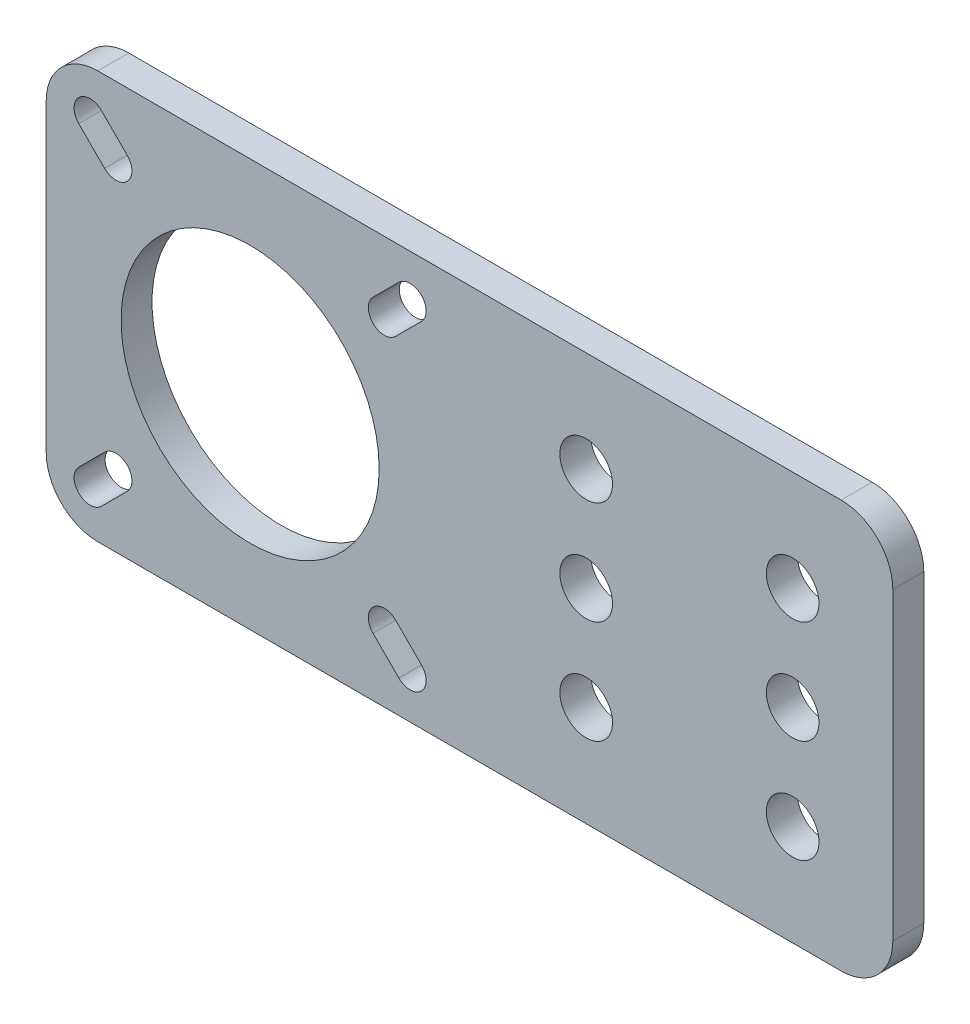
ISO-10303-21;
HEADER;
FILE_DESCRIPTION(('STEP AP214'),'2;1');
FILE_NAME('part.step','',(''),(''),'','','');
FILE_SCHEMA(('AUTOMOTIVE_DESIGN { 1 0 10303 214 1 1 1 1 }'));
ENDSEC;
DATA;
#1=APPLICATION_CONTEXT('core data for automotive mechanical design processes');
#2=APPLICATION_PROTOCOL_DEFINITION('international standard','automotive_design',2000,#1);
#3=PRODUCT_CONTEXT('',#1,'mechanical');
#4=PRODUCT('Part','Part','',(#3));
#5=PRODUCT_RELATED_PRODUCT_CATEGORY('part','',(#4));
#6=PRODUCT_DEFINITION_FORMATION('','',#4);
#7=PRODUCT_DEFINITION_CONTEXT('part definition',#1,'design');
#8=PRODUCT_DEFINITION('design','',#6,#7);
#9=PRODUCT_DEFINITION_SHAPE('','',#8);
#10=(LENGTH_UNIT() NAMED_UNIT(*) SI_UNIT(.MILLI.,.METRE.));
#11=(NAMED_UNIT(*) PLANE_ANGLE_UNIT() SI_UNIT($,.RADIAN.));
#12=(NAMED_UNIT(*) SI_UNIT($,.STERADIAN.) SOLID_ANGLE_UNIT());
#13=UNCERTAINTY_MEASURE_WITH_UNIT(LENGTH_MEASURE(1.E-05),#10,'distance_accuracy_value','');
#14=(GEOMETRIC_REPRESENTATION_CONTEXT(3) GLOBAL_UNCERTAINTY_ASSIGNED_CONTEXT((#13)) GLOBAL_UNIT_ASSIGNED_CONTEXT((#10,
#11,#12)) REPRESENTATION_CONTEXT('',''));
#15=CARTESIAN_POINT('',(0.,0.,0.));
#16=DIRECTION('',(0.,0.,1.));
#17=DIRECTION('',(1.,0.,0.));
#18=AXIS2_PLACEMENT_3D('',#15,#16,#17);
#19=CARTESIAN_POINT('',(0.,0.,3.));
#20=DIRECTION('',(0.,0.,-1.));
#21=DIRECTION('',(-1.,0.,0.));
#22=AXIS2_PLACEMENT_3D('',#19,#20,#21);
#23=PLANE('',#22);
#24=CARTESIAN_POINT('',(72.2999999999999,19.75,3.));
#25=DIRECTION('',(0.,0.,1.));
#26=DIRECTION('',(-1.,0.,0.));
#27=AXIS2_PLACEMENT_3D('',#24,#25,#26);
#28=CIRCLE('',#27,2.55000000000001);
#29=CARTESIAN_POINT('',(69.7499999999999,19.75,3.));
#30=VERTEX_POINT('',#29);
#31=EDGE_CURVE('E742',#30,#30,#28,.T.);
#32=ORIENTED_EDGE('',*,*,#31,.F.);
#33=EDGE_LOOP('',(#32));
#34=FACE_BOUND('',#33,.T.);
#35=CARTESIAN_POINT('',(52.2999999999998,9.75,3.));
#36=DIRECTION('',(0.,0.,1.));
#37=DIRECTION('',(1.,0.,0.));
#38=AXIS2_PLACEMENT_3D('',#35,#36,#37);
#39=CIRCLE('',#38,2.55);
#40=CARTESIAN_POINT('',(54.8499999999998,9.75,3.));
#41=VERTEX_POINT('',#40);
#42=EDGE_CURVE('E754',#41,#41,#39,.T.);
#43=ORIENTED_EDGE('',*,*,#42,.F.);
#44=EDGE_LOOP('',(#43));
#45=FACE_BOUND('',#44,.T.);
#46=CARTESIAN_POINT('',(52.2999999999998,19.75,3.));
#47=DIRECTION('',(0.,0.,1.));
#48=DIRECTION('',(1.,0.,0.));
#49=AXIS2_PLACEMENT_3D('',#46,#47,#48);
#50=CIRCLE('',#49,2.55);
#51=CARTESIAN_POINT('',(54.8499999999998,19.75,3.));
#52=VERTEX_POINT('',#51);
#53=EDGE_CURVE('E228',#52,#52,#50,.T.);
#54=ORIENTED_EDGE('',*,*,#53,.F.);
#55=EDGE_LOOP('',(#54));
#56=FACE_BOUND('',#55,.T.);
#57=CARTESIAN_POINT('',(35.2499999999996,4.25,3.));
#58=DIRECTION('',(0.,0.,1.));
#59=DIRECTION('',(1.,0.,0.));
#60=AXIS2_PLACEMENT_3D('',#57,#58,#59);
#61=CIRCLE('',#60,1.55);
#62=CARTESIAN_POINT('',(34.1539844891605,3.15398448916086,3.));
#63=VERTEX_POINT('',#62);
#64=CARTESIAN_POINT('',(36.3460155108388,5.34601551083915,3.));
#65=VERTEX_POINT('',#64);
#66=EDGE_CURVE('E239',#63,#65,#61,.T.);
#67=ORIENTED_EDGE('',*,*,#66,.F.);
#68=DIRECTION('',(0.707106781186543,-0.707106781186552,0.));
#69=VECTOR('',#68,1.);
#70=CARTESIAN_POINT('',(34.1539844891605,3.15398448916086,3.));
#71=LINE('',#70,#69);
#72=CARTESIAN_POINT('',(31.6539844891605,5.65398448916084,3.));
#73=VERTEX_POINT('',#72);
#74=EDGE_CURVE('E247',#73,#63,#71,.T.);
#75=ORIENTED_EDGE('',*,*,#74,.F.);
#76=CARTESIAN_POINT('',(32.7499999999997,6.74999999999999,3.));
#77=DIRECTION('',(0.,0.,1.));
#78=DIRECTION('',(1.,0.,0.));
#79=AXIS2_PLACEMENT_3D('',#76,#77,#78);
#80=CIRCLE('',#79,1.55);
#81=CARTESIAN_POINT('',(33.8460155108388,7.84601551083913,3.));
#82=VERTEX_POINT('',#81);
#83=EDGE_CURVE('E244',#82,#73,#80,.T.);
#84=ORIENTED_EDGE('',*,*,#83,.F.);
#85=DIRECTION('',(-0.707106781186543,0.707106781186552,0.));
#86=VECTOR('',#85,1.);
#87=CARTESIAN_POINT('',(36.3460155108388,5.34601551083915,3.));
#88=LINE('',#87,#86);
#89=EDGE_CURVE('E241',#65,#82,#88,.T.);
#90=ORIENTED_EDGE('',*,*,#89,.F.);
#91=EDGE_LOOP('',(#67,#75,#84,#90));
#92=FACE_BOUND('',#91,.T.);
#93=CARTESIAN_POINT('',(4.24999999999997,35.25,3.));
#94=DIRECTION('',(0.,0.,1.));
#95=DIRECTION('',(1.,0.,0.));
#96=AXIS2_PLACEMENT_3D('',#93,#94,#95);
#97=CIRCLE('',#96,1.55);
#98=CARTESIAN_POINT('',(5.34601551083912,36.3460155108391,3.));
#99=VERTEX_POINT('',#98);
#100=CARTESIAN_POINT('',(3.15398448916081,34.1539844891608,3.));
#101=VERTEX_POINT('',#100);
#102=EDGE_CURVE('E301',#99,#101,#97,.T.);
#103=ORIENTED_EDGE('',*,*,#102,.F.);
#104=DIRECTION('',(-0.707106781186544,0.707106781186551,0.));
#105=VECTOR('',#104,1.);
#106=CARTESIAN_POINT('',(5.34601551083912,36.3460155108391,3.));
#107=LINE('',#106,#105);
#108=CARTESIAN_POINT('',(7.84601551083908,33.8460155108392,3.));
#109=VERTEX_POINT('',#108);
#110=EDGE_CURVE('E309',#109,#99,#107,.T.);
#111=ORIENTED_EDGE('',*,*,#110,.F.);
#112=CARTESIAN_POINT('',(6.74999999999993,32.75,3.));
#113=DIRECTION('',(0.,0.,1.));
#114=DIRECTION('',(1.,0.,0.));
#115=AXIS2_PLACEMENT_3D('',#112,#113,#114);
#116=CIRCLE('',#115,1.55);
#117=CARTESIAN_POINT('',(5.65398448916077,31.6539844891609,3.));
#118=VERTEX_POINT('',#117);
#119=EDGE_CURVE('E306',#118,#109,#116,.T.);
#120=ORIENTED_EDGE('',*,*,#119,.F.);
#121=DIRECTION('',(0.707106781186543,-0.707106781186552,0.));
#122=VECTOR('',#121,1.);
#123=CARTESIAN_POINT('',(3.15398448916081,34.1539844891608,3.));
#124=LINE('',#123,#122);
#125=EDGE_CURVE('E303',#101,#118,#124,.T.);
#126=ORIENTED_EDGE('',*,*,#125,.F.);
#127=EDGE_LOOP('',(#103,#111,#120,#126));
#128=FACE_BOUND('',#127,.T.);
#129=DIRECTION('',(0.,-1.,0.));
#130=VECTOR('',#129,1.);
#131=CARTESIAN_POINT('',(0.,0.,3.));
#132=LINE('',#131,#130);
#133=CARTESIAN_POINT('',(0.,34.5,3.));
#134=VERTEX_POINT('',#133);
#135=CARTESIAN_POINT('',(0.,5.,3.));
#136=VERTEX_POINT('',#135);
#137=EDGE_CURVE('E338',#134,#136,#132,.T.);
#138=ORIENTED_EDGE('',*,*,#137,.T.);
#139=CARTESIAN_POINT('',(5.,5.,3.));
#140=DIRECTION('',(0.,0.,-1.));
#141=DIRECTION('',(-1.,0.,0.));
#142=AXIS2_PLACEMENT_3D('',#139,#140,#141);
#143=CIRCLE('',#142,5.);
#144=CARTESIAN_POINT('',(5.,0.,3.));
#145=VERTEX_POINT('',#144);
#146=EDGE_CURVE('E381',#136,#145,#143,.F.);
#147=ORIENTED_EDGE('',*,*,#146,.T.);
#148=DIRECTION('',(1.,0.,0.));
#149=VECTOR('',#148,1.);
#150=CARTESIAN_POINT('',(0.,0.,3.));
#151=LINE('',#150,#149);
#152=CARTESIAN_POINT('',(77.,0.,3.));
#153=VERTEX_POINT('',#152);
#154=EDGE_CURVE('E341',#145,#153,#151,.T.);
#155=ORIENTED_EDGE('',*,*,#154,.T.);
#156=CARTESIAN_POINT('',(77.,5.,3.));
#157=DIRECTION('',(0.,0.,-1.));
#158=DIRECTION('',(-1.,0.,0.));
#159=AXIS2_PLACEMENT_3D('',#156,#157,#158);
#160=CIRCLE('',#159,5.);
#161=CARTESIAN_POINT('',(82.,5.,3.));
#162=VERTEX_POINT('',#161);
#163=EDGE_CURVE('E379',#153,#162,#160,.F.);
#164=ORIENTED_EDGE('',*,*,#163,.T.);
#165=DIRECTION('',(0.,1.,0.));
#166=VECTOR('',#165,1.);
#167=CARTESIAN_POINT('',(82.,0.,3.));
#168=LINE('',#167,#166);
#169=CARTESIAN_POINT('',(82.,34.5,3.));
#170=VERTEX_POINT('',#169);
#171=EDGE_CURVE('E345',#162,#170,#168,.T.);
#172=ORIENTED_EDGE('',*,*,#171,.T.);
#173=CARTESIAN_POINT('',(77.,34.5,3.));
#174=DIRECTION('',(0.,0.,-1.));
#175=DIRECTION('',(-1.,0.,0.));
#176=AXIS2_PLACEMENT_3D('',#173,#174,#175);
#177=CIRCLE('',#176,5.);
#178=CARTESIAN_POINT('',(77.,39.5,3.));
#179=VERTEX_POINT('',#178);
#180=EDGE_CURVE('E53',#170,#179,#177,.F.);
#181=ORIENTED_EDGE('',*,*,#180,.T.);
#182=DIRECTION('',(-1.,0.,0.));
#183=VECTOR('',#182,1.);
#184=CARTESIAN_POINT('',(0.,39.5,3.));
#185=LINE('',#184,#183);
#186=CARTESIAN_POINT('',(5.,39.5,3.));
#187=VERTEX_POINT('',#186);
#188=EDGE_CURVE('E347',#179,#187,#185,.T.);
#189=ORIENTED_EDGE('',*,*,#188,.T.);
#190=CARTESIAN_POINT('',(5.,34.5,3.));
#191=DIRECTION('',(0.,0.,-1.));
#192=DIRECTION('',(-1.,0.,0.));
#193=AXIS2_PLACEMENT_3D('',#190,#191,#192);
#194=CIRCLE('',#193,5.);
#195=EDGE_CURVE('E376',#187,#134,#194,.F.);
#196=ORIENTED_EDGE('',*,*,#195,.T.);
#197=EDGE_LOOP('',(#138,#147,#155,#164,#172,#181,#189,#196));
#198=FACE_BOUND('',#197,.T.);
#199=CARTESIAN_POINT('',(19.7499999999998,19.75,3.));
#200=DIRECTION('',(0.,0.,1.));
#201=DIRECTION('',(1.,0.,0.));
#202=AXIS2_PLACEMENT_3D('',#199,#200,#201);
#203=CIRCLE('',#202,12.5);
#204=CARTESIAN_POINT('',(32.2499999999998,19.75,3.));
#205=VERTEX_POINT('',#204);
#206=EDGE_CURVE('E332',#205,#205,#203,.T.);
#207=ORIENTED_EDGE('',*,*,#206,.F.);
#208=EDGE_LOOP('',(#207));
#209=FACE_BOUND('',#208,.T.);
#210=CARTESIAN_POINT('',(35.2499999999996,35.25,3.));
#211=DIRECTION('',(0.,0.,1.));
#212=DIRECTION('',(-1.,0.,0.));
#213=AXIS2_PLACEMENT_3D('',#210,#211,#212);
#214=CIRCLE('',#213,1.55);
#215=CARTESIAN_POINT('',(36.3460155108388,34.1539844891608,3.));
#216=VERTEX_POINT('',#215);
#217=CARTESIAN_POINT('',(34.1539844891605,36.3460155108391,3.));
#218=VERTEX_POINT('',#217);
#219=EDGE_CURVE('E270',#216,#218,#214,.T.);
#220=ORIENTED_EDGE('',*,*,#219,.F.);
#221=DIRECTION('',(0.707106781186542,0.707106781186553,0.));
#222=VECTOR('',#221,1.);
#223=CARTESIAN_POINT('',(36.3460155108388,34.1539844891608,3.));
#224=LINE('',#223,#222);
#225=CARTESIAN_POINT('',(33.8460155108388,31.6539844891609,3.));
#226=VERTEX_POINT('',#225);
#227=EDGE_CURVE('E278',#226,#216,#224,.T.);
#228=ORIENTED_EDGE('',*,*,#227,.F.);
#229=CARTESIAN_POINT('',(32.7499999999997,32.75,3.));
#230=DIRECTION('',(0.,0.,1.));
#231=DIRECTION('',(-1.,0.,0.));
#232=AXIS2_PLACEMENT_3D('',#229,#230,#231);
#233=CIRCLE('',#232,1.55);
#234=CARTESIAN_POINT('',(31.6539844891605,33.8460155108392,3.));
#235=VERTEX_POINT('',#234);
#236=EDGE_CURVE('E275',#235,#226,#233,.T.);
#237=ORIENTED_EDGE('',*,*,#236,.F.);
#238=DIRECTION('',(-0.707106781186542,-0.707106781186553,0.));
#239=VECTOR('',#238,1.);
#240=CARTESIAN_POINT('',(34.1539844891605,36.3460155108391,3.));
#241=LINE('',#240,#239);
#242=EDGE_CURVE('E272',#218,#235,#241,.T.);
#243=ORIENTED_EDGE('',*,*,#242,.F.);
#244=EDGE_LOOP('',(#220,#228,#237,#243));
#245=FACE_BOUND('',#244,.T.);
#246=CARTESIAN_POINT('',(4.24999999999997,4.25,3.));
#247=DIRECTION('',(0.,0.,1.));
#248=DIRECTION('',(-1.,0.,0.));
#249=AXIS2_PLACEMENT_3D('',#246,#247,#248);
#250=CIRCLE('',#249,1.55);
#251=CARTESIAN_POINT('',(3.15398448916081,5.34601551083915,3.));
#252=VERTEX_POINT('',#251);
#253=CARTESIAN_POINT('',(5.34601551083912,3.15398448916086,3.));
#254=VERTEX_POINT('',#253);
#255=EDGE_CURVE('E195',#252,#254,#250,.T.);
#256=ORIENTED_EDGE('',*,*,#255,.F.);
#257=DIRECTION('',(-0.707106781186543,-0.707106781186552,0.));
#258=VECTOR('',#257,1.);
#259=CARTESIAN_POINT('',(3.15398448916081,5.34601551083915,3.));
#260=LINE('',#259,#258);
#261=CARTESIAN_POINT('',(5.65398448916076,7.84601551083913,3.));
#262=VERTEX_POINT('',#261);
#263=EDGE_CURVE('E221',#262,#252,#260,.T.);
#264=ORIENTED_EDGE('',*,*,#263,.F.);
#265=CARTESIAN_POINT('',(6.74999999999992,6.75,3.));
#266=DIRECTION('',(0.,0.,1.));
#267=DIRECTION('',(-1.,0.,0.));
#268=AXIS2_PLACEMENT_3D('',#265,#266,#267);
#269=CIRCLE('',#268,1.55);
#270=CARTESIAN_POINT('',(7.84601551083908,5.65398448916085,3.));
#271=VERTEX_POINT('',#270);
#272=EDGE_CURVE('E219',#271,#262,#269,.T.);
#273=ORIENTED_EDGE('',*,*,#272,.F.);
#274=DIRECTION('',(0.707106781186544,0.707106781186551,0.));
#275=VECTOR('',#274,1.);
#276=CARTESIAN_POINT('',(5.34601551083912,3.15398448916086,3.));
#277=LINE('',#276,#275);
#278=EDGE_CURVE('E205',#254,#271,#277,.T.);
#279=ORIENTED_EDGE('',*,*,#278,.F.);
#280=EDGE_LOOP('',(#256,#264,#273,#279));
#281=FACE_BOUND('',#280,.T.);
#282=CARTESIAN_POINT('',(52.2999999999998,29.75,3.));
#283=DIRECTION('',(0.,0.,1.));
#284=DIRECTION('',(1.,0.,0.));
#285=AXIS2_PLACEMENT_3D('',#282,#283,#284);
#286=CIRCLE('',#285,2.55);
#287=CARTESIAN_POINT('',(54.8499999999998,29.75,3.));
#288=VERTEX_POINT('',#287);
#289=EDGE_CURVE('E760',#288,#288,#286,.T.);
#290=ORIENTED_EDGE('',*,*,#289,.F.);
#291=EDGE_LOOP('',(#290));
#292=FACE_BOUND('',#291,.T.);
#293=CARTESIAN_POINT('',(72.2999999999998,9.75,3.));
#294=DIRECTION('',(0.,0.,1.));
#295=DIRECTION('',(-1.,0.,0.));
#296=AXIS2_PLACEMENT_3D('',#293,#294,#295);
#297=CIRCLE('',#296,2.55000000000001);
#298=CARTESIAN_POINT('',(69.7499999999998,9.75,3.));
#299=VERTEX_POINT('',#298);
#300=EDGE_CURVE('E748',#299,#299,#297,.T.);
#301=ORIENTED_EDGE('',*,*,#300,.F.);
#302=EDGE_LOOP('',(#301));
#303=FACE_BOUND('',#302,.T.);
#304=CARTESIAN_POINT('',(72.2999999999998,29.75,3.));
#305=DIRECTION('',(0.,0.,1.));
#306=DIRECTION('',(-1.,0.,0.));
#307=AXIS2_PLACEMENT_3D('',#304,#305,#306);
#308=CIRCLE('',#307,2.55000000000001);
#309=CARTESIAN_POINT('',(69.7499999999998,29.75,3.));
#310=VERTEX_POINT('',#309);
#311=EDGE_CURVE('E733',#310,#310,#308,.T.);
#312=ORIENTED_EDGE('',*,*,#311,.F.);
#313=EDGE_LOOP('',(#312));
#314=FACE_BOUND('',#313,.T.);
#315=ADVANCED_FACE('F32',(#34,#45,#56,#92,#128,#198,#209,#245,#281,#292,#303,#314),#23,.F.);
#316=CARTESIAN_POINT('',(0.,0.,0.));
#317=DIRECTION('',(0.,0.,-1.));
#318=DIRECTION('',(-1.,0.,0.));
#319=AXIS2_PLACEMENT_3D('',#316,#317,#318);
#320=PLANE('',#319);
#321=CARTESIAN_POINT('',(72.2999999999999,19.75,0.));
#322=DIRECTION('',(0.,0.,1.));
#323=DIRECTION('',(-1.,0.,0.));
#324=AXIS2_PLACEMENT_3D('',#321,#322,#323);
#325=CIRCLE('',#324,2.55000000000001);
#326=CARTESIAN_POINT('',(69.7499999999999,19.75,0.));
#327=VERTEX_POINT('',#326);
#328=EDGE_CURVE('E739',#327,#327,#325,.T.);
#329=ORIENTED_EDGE('',*,*,#328,.T.);
#330=EDGE_LOOP('',(#329));
#331=FACE_BOUND('',#330,.T.);
#332=CARTESIAN_POINT('',(52.2999999999998,9.75,0.));
#333=DIRECTION('',(0.,0.,1.));
#334=DIRECTION('',(1.,0.,0.));
#335=AXIS2_PLACEMENT_3D('',#332,#333,#334);
#336=CIRCLE('',#335,2.55);
#337=CARTESIAN_POINT('',(54.8499999999998,9.75,0.));
#338=VERTEX_POINT('',#337);
#339=EDGE_CURVE('E751',#338,#338,#336,.T.);
#340=ORIENTED_EDGE('',*,*,#339,.T.);
#341=EDGE_LOOP('',(#340));
#342=FACE_BOUND('',#341,.T.);
#343=CARTESIAN_POINT('',(52.2999999999998,19.75,0.));
#344=DIRECTION('',(0.,0.,1.));
#345=DIRECTION('',(1.,0.,0.));
#346=AXIS2_PLACEMENT_3D('',#343,#344,#345);
#347=CIRCLE('',#346,2.55);
#348=CARTESIAN_POINT('',(54.8499999999998,19.75,0.));
#349=VERTEX_POINT('',#348);
#350=EDGE_CURVE('E763',#349,#349,#347,.T.);
#351=ORIENTED_EDGE('',*,*,#350,.T.);
#352=EDGE_LOOP('',(#351));
#353=FACE_BOUND('',#352,.T.);
#354=DIRECTION('',(0.707106781186543,-0.707106781186552,0.));
#355=VECTOR('',#354,1.);
#356=CARTESIAN_POINT('',(34.1539844891605,3.15398448916086,0.));
#357=LINE('',#356,#355);
#358=CARTESIAN_POINT('',(31.6539844891605,5.65398448916084,0.));
#359=VERTEX_POINT('',#358);
#360=CARTESIAN_POINT('',(34.1539844891605,3.15398448916087,0.));
#361=VERTEX_POINT('',#360);
#362=EDGE_CURVE('E242',#359,#361,#357,.T.);
#363=ORIENTED_EDGE('',*,*,#362,.T.);
#364=CARTESIAN_POINT('',(35.2499999999996,4.25,0.));
#365=DIRECTION('',(0.,0.,1.));
#366=DIRECTION('',(1.,0.,0.));
#367=AXIS2_PLACEMENT_3D('',#364,#365,#366);
#368=CIRCLE('',#367,1.55);
#369=CARTESIAN_POINT('',(36.3460155108388,5.34601551083915,0.));
#370=VERTEX_POINT('',#369);
#371=EDGE_CURVE('E213',#361,#370,#368,.T.);
#372=ORIENTED_EDGE('',*,*,#371,.T.);
#373=DIRECTION('',(-0.707106781186543,0.707106781186552,0.));
#374=VECTOR('',#373,1.);
#375=CARTESIAN_POINT('',(36.3460155108388,5.34601551083915,0.));
#376=LINE('',#375,#374);
#377=CARTESIAN_POINT('',(33.8460155108388,7.84601551083913,0.));
#378=VERTEX_POINT('',#377);
#379=EDGE_CURVE('E252',#370,#378,#376,.T.);
#380=ORIENTED_EDGE('',*,*,#379,.T.);
#381=CARTESIAN_POINT('',(32.7499999999997,6.74999999999999,0.));
#382=DIRECTION('',(0.,0.,1.));
#383=DIRECTION('',(1.,0.,0.));
#384=AXIS2_PLACEMENT_3D('',#381,#382,#383);
#385=CIRCLE('',#384,1.55);
#386=EDGE_CURVE('E255',#378,#359,#385,.T.);
#387=ORIENTED_EDGE('',*,*,#386,.T.);
#388=EDGE_LOOP('',(#363,#372,#380,#387));
#389=FACE_BOUND('',#388,.T.);
#390=DIRECTION('',(-0.707106781186544,0.707106781186551,0.));
#391=VECTOR('',#390,1.);
#392=CARTESIAN_POINT('',(5.34601551083912,36.3460155108391,0.));
#393=LINE('',#392,#391);
#394=CARTESIAN_POINT('',(7.84601551083908,33.8460155108392,0.));
#395=VERTEX_POINT('',#394);
#396=CARTESIAN_POINT('',(5.34601551083912,36.3460155108391,0.));
#397=VERTEX_POINT('',#396);
#398=EDGE_CURVE('E304',#395,#397,#393,.T.);
#399=ORIENTED_EDGE('',*,*,#398,.T.);
#400=CARTESIAN_POINT('',(4.24999999999997,35.25,0.));
#401=DIRECTION('',(0.,0.,1.));
#402=DIRECTION('',(1.,0.,0.));
#403=AXIS2_PLACEMENT_3D('',#400,#401,#402);
#404=CIRCLE('',#403,1.55);
#405=CARTESIAN_POINT('',(3.15398448916081,34.1539844891608,0.));
#406=VERTEX_POINT('',#405);
#407=EDGE_CURVE('E300',#397,#406,#404,.T.);
#408=ORIENTED_EDGE('',*,*,#407,.T.);
#409=DIRECTION('',(0.707106781186543,-0.707106781186552,0.));
#410=VECTOR('',#409,1.);
#411=CARTESIAN_POINT('',(3.15398448916081,34.1539844891608,0.));
#412=LINE('',#411,#410);
#413=CARTESIAN_POINT('',(5.65398448916077,31.6539844891609,0.));
#414=VERTEX_POINT('',#413);
#415=EDGE_CURVE('E314',#406,#414,#412,.T.);
#416=ORIENTED_EDGE('',*,*,#415,.T.);
#417=CARTESIAN_POINT('',(6.74999999999993,32.75,0.));
#418=DIRECTION('',(0.,0.,1.));
#419=DIRECTION('',(1.,0.,0.));
#420=AXIS2_PLACEMENT_3D('',#417,#418,#419);
#421=CIRCLE('',#420,1.55);
#422=EDGE_CURVE('E317',#414,#395,#421,.T.);
#423=ORIENTED_EDGE('',*,*,#422,.T.);
#424=EDGE_LOOP('',(#399,#408,#416,#423));
#425=FACE_BOUND('',#424,.T.);
#426=DIRECTION('',(1.,0.,0.));
#427=VECTOR('',#426,1.);
#428=CARTESIAN_POINT('',(0.,0.,0.));
#429=LINE('',#428,#427);
#430=CARTESIAN_POINT('',(5.,0.,0.));
#431=VERTEX_POINT('',#430);
#432=CARTESIAN_POINT('',(77.,0.,0.));
#433=VERTEX_POINT('',#432);
#434=EDGE_CURVE('E352',#431,#433,#429,.T.);
#435=ORIENTED_EDGE('',*,*,#434,.F.);
#436=CARTESIAN_POINT('',(5.,5.,0.));
#437=DIRECTION('',(0.,0.,-1.));
#438=DIRECTION('',(-1.,0.,0.));
#439=AXIS2_PLACEMENT_3D('',#436,#437,#438);
#440=CIRCLE('',#439,5.);
#441=CARTESIAN_POINT('',(0.,5.,0.));
#442=VERTEX_POINT('',#441);
#443=EDGE_CURVE('E369',#431,#442,#440,.T.);
#444=ORIENTED_EDGE('',*,*,#443,.T.);
#445=DIRECTION('',(0.,-1.,0.));
#446=VECTOR('',#445,1.);
#447=CARTESIAN_POINT('',(0.,0.,0.));
#448=LINE('',#447,#446);
#449=CARTESIAN_POINT('',(0.,34.5,0.));
#450=VERTEX_POINT('',#449);
#451=EDGE_CURVE('E335',#450,#442,#448,.T.);
#452=ORIENTED_EDGE('',*,*,#451,.F.);
#453=CARTESIAN_POINT('',(5.,34.5,0.));
#454=DIRECTION('',(0.,0.,-1.));
#455=DIRECTION('',(-1.,0.,0.));
#456=AXIS2_PLACEMENT_3D('',#453,#454,#455);
#457=CIRCLE('',#456,5.);
#458=CARTESIAN_POINT('',(5.,39.5,0.));
#459=VERTEX_POINT('',#458);
#460=EDGE_CURVE('E363',#450,#459,#457,.T.);
#461=ORIENTED_EDGE('',*,*,#460,.T.);
#462=DIRECTION('',(-1.,0.,0.));
#463=VECTOR('',#462,1.);
#464=CARTESIAN_POINT('',(0.,39.5,0.));
#465=LINE('',#464,#463);
#466=CARTESIAN_POINT('',(77.,39.5,0.));
#467=VERTEX_POINT('',#466);
#468=EDGE_CURVE('E342',#467,#459,#465,.T.);
#469=ORIENTED_EDGE('',*,*,#468,.F.);
#470=CARTESIAN_POINT('',(77.,34.5,0.));
#471=DIRECTION('',(0.,0.,-1.));
#472=DIRECTION('',(-1.,0.,0.));
#473=AXIS2_PLACEMENT_3D('',#470,#471,#472);
#474=CIRCLE('',#473,5.);
#475=CARTESIAN_POINT('',(82.,34.5,0.));
#476=VERTEX_POINT('',#475);
#477=EDGE_CURVE('E365',#467,#476,#474,.T.);
#478=ORIENTED_EDGE('',*,*,#477,.T.);
#479=DIRECTION('',(0.,1.,0.));
#480=VECTOR('',#479,1.);
#481=CARTESIAN_POINT('',(82.,0.,0.));
#482=LINE('',#481,#480);
#483=CARTESIAN_POINT('',(82.,5.,0.));
#484=VERTEX_POINT('',#483);
#485=EDGE_CURVE('E355',#484,#476,#482,.T.);
#486=ORIENTED_EDGE('',*,*,#485,.F.);
#487=CARTESIAN_POINT('',(77.,5.,0.));
#488=DIRECTION('',(0.,0.,-1.));
#489=DIRECTION('',(-1.,0.,0.));
#490=AXIS2_PLACEMENT_3D('',#487,#488,#489);
#491=CIRCLE('',#490,5.);
#492=EDGE_CURVE('E367',#484,#433,#491,.T.);
#493=ORIENTED_EDGE('',*,*,#492,.T.);
#494=EDGE_LOOP('',(#435,#444,#452,#461,#469,#478,#486,#493));
#495=FACE_BOUND('',#494,.T.);
#496=CARTESIAN_POINT('',(19.7499999999998,19.75,0.));
#497=DIRECTION('',(0.,0.,1.));
#498=DIRECTION('',(1.,0.,0.));
#499=AXIS2_PLACEMENT_3D('',#496,#497,#498);
#500=CIRCLE('',#499,12.5);
#501=CARTESIAN_POINT('',(32.2499999999998,19.75,0.));
#502=VERTEX_POINT('',#501);
#503=EDGE_CURVE('E331',#502,#502,#500,.T.);
#504=ORIENTED_EDGE('',*,*,#503,.T.);
#505=EDGE_LOOP('',(#504));
#506=FACE_BOUND('',#505,.T.);
#507=DIRECTION('',(0.707106781186542,0.707106781186553,0.));
#508=VECTOR('',#507,1.);
#509=CARTESIAN_POINT('',(36.3460155108388,34.1539844891608,0.));
#510=LINE('',#509,#508);
#511=CARTESIAN_POINT('',(33.8460155108388,31.6539844891609,0.));
#512=VERTEX_POINT('',#511);
#513=CARTESIAN_POINT('',(36.3460155108388,34.1539844891608,0.));
#514=VERTEX_POINT('',#513);
#515=EDGE_CURVE('E273',#512,#514,#510,.T.);
#516=ORIENTED_EDGE('',*,*,#515,.T.);
#517=CARTESIAN_POINT('',(35.2499999999996,35.25,0.));
#518=DIRECTION('',(0.,0.,1.));
#519=DIRECTION('',(-1.,0.,0.));
#520=AXIS2_PLACEMENT_3D('',#517,#518,#519);
#521=CIRCLE('',#520,1.55);
#522=CARTESIAN_POINT('',(34.1539844891605,36.3460155108391,0.));
#523=VERTEX_POINT('',#522);
#524=EDGE_CURVE('E269',#514,#523,#521,.T.);
#525=ORIENTED_EDGE('',*,*,#524,.T.);
#526=DIRECTION('',(-0.707106781186542,-0.707106781186553,0.));
#527=VECTOR('',#526,1.);
#528=CARTESIAN_POINT('',(34.1539844891605,36.3460155108391,0.));
#529=LINE('',#528,#527);
#530=CARTESIAN_POINT('',(31.6539844891605,33.8460155108392,0.));
#531=VERTEX_POINT('',#530);
#532=EDGE_CURVE('E283',#523,#531,#529,.T.);
#533=ORIENTED_EDGE('',*,*,#532,.T.);
#534=CARTESIAN_POINT('',(32.7499999999997,32.75,0.));
#535=DIRECTION('',(0.,0.,1.));
#536=DIRECTION('',(-1.,0.,0.));
#537=AXIS2_PLACEMENT_3D('',#534,#535,#536);
#538=CIRCLE('',#537,1.55);
#539=EDGE_CURVE('E286',#531,#512,#538,.T.);
#540=ORIENTED_EDGE('',*,*,#539,.T.);
#541=EDGE_LOOP('',(#516,#525,#533,#540));
#542=FACE_BOUND('',#541,.T.);
#543=DIRECTION('',(-0.707106781186543,-0.707106781186552,0.));
#544=VECTOR('',#543,1.);
#545=CARTESIAN_POINT('',(3.15398448916081,5.34601551083915,0.));
#546=LINE('',#545,#544);
#547=CARTESIAN_POINT('',(5.65398448916076,7.84601551083914,0.));
#548=VERTEX_POINT('',#547);
#549=CARTESIAN_POINT('',(3.15398448916081,5.34601551083915,0.));
#550=VERTEX_POINT('',#549);
#551=EDGE_CURVE('E206',#548,#550,#546,.T.);
#552=ORIENTED_EDGE('',*,*,#551,.T.);
#553=CARTESIAN_POINT('',(4.24999999999997,4.25,0.));
#554=DIRECTION('',(0.,0.,1.));
#555=DIRECTION('',(-1.,0.,0.));
#556=AXIS2_PLACEMENT_3D('',#553,#554,#555);
#557=CIRCLE('',#556,1.55);
#558=CARTESIAN_POINT('',(5.34601551083912,3.15398448916086,0.));
#559=VERTEX_POINT('',#558);
#560=EDGE_CURVE('E226',#550,#559,#557,.T.);
#561=ORIENTED_EDGE('',*,*,#560,.T.);
#562=DIRECTION('',(0.707106781186544,0.707106781186551,0.));
#563=VECTOR('',#562,1.);
#564=CARTESIAN_POINT('',(5.34601551083912,3.15398448916086,0.));
#565=LINE('',#564,#563);
#566=CARTESIAN_POINT('',(7.84601551083908,5.65398448916085,0.));
#567=VERTEX_POINT('',#566);
#568=EDGE_CURVE('E212',#559,#567,#565,.T.);
#569=ORIENTED_EDGE('',*,*,#568,.T.);
#570=CARTESIAN_POINT('',(6.74999999999992,6.75,0.));
#571=DIRECTION('',(0.,0.,1.));
#572=DIRECTION('',(-1.,0.,0.));
#573=AXIS2_PLACEMENT_3D('',#570,#571,#572);
#574=CIRCLE('',#573,1.55);
#575=EDGE_CURVE('E230',#567,#548,#574,.T.);
#576=ORIENTED_EDGE('',*,*,#575,.T.);
#577=EDGE_LOOP('',(#552,#561,#569,#576));
#578=FACE_BOUND('',#577,.T.);
#579=CARTESIAN_POINT('',(52.2999999999998,29.75,0.));
#580=DIRECTION('',(0.,0.,1.));
#581=DIRECTION('',(1.,0.,0.));
#582=AXIS2_PLACEMENT_3D('',#579,#580,#581);
#583=CIRCLE('',#582,2.55);
#584=CARTESIAN_POINT('',(54.8499999999998,29.75,0.));
#585=VERTEX_POINT('',#584);
#586=EDGE_CURVE('E757',#585,#585,#583,.T.);
#587=ORIENTED_EDGE('',*,*,#586,.T.);
#588=EDGE_LOOP('',(#587));
#589=FACE_BOUND('',#588,.T.);
#590=CARTESIAN_POINT('',(72.2999999999998,9.75,0.));
#591=DIRECTION('',(0.,0.,1.));
#592=DIRECTION('',(-1.,0.,0.));
#593=AXIS2_PLACEMENT_3D('',#590,#591,#592);
#594=CIRCLE('',#593,2.55000000000001);
#595=CARTESIAN_POINT('',(69.7499999999998,9.75,0.));
#596=VERTEX_POINT('',#595);
#597=EDGE_CURVE('E745',#596,#596,#594,.T.);
#598=ORIENTED_EDGE('',*,*,#597,.T.);
#599=EDGE_LOOP('',(#598));
#600=FACE_BOUND('',#599,.T.);
#601=CARTESIAN_POINT('',(72.2999999999998,29.75,0.));
#602=DIRECTION('',(0.,0.,1.));
#603=DIRECTION('',(-1.,0.,0.));
#604=AXIS2_PLACEMENT_3D('',#601,#602,#603);
#605=CIRCLE('',#604,2.55000000000001);
#606=CARTESIAN_POINT('',(69.7499999999998,29.75,0.));
#607=VERTEX_POINT('',#606);
#608=EDGE_CURVE('E736',#607,#607,#605,.T.);
#609=ORIENTED_EDGE('',*,*,#608,.T.);
#610=EDGE_LOOP('',(#609));
#611=FACE_BOUND('',#610,.T.);
#612=ADVANCED_FACE('F397',(#331,#342,#353,#389,#425,#495,#506,#542,#578,#589,#600,#611),#320,.T.);
#613=CARTESIAN_POINT('',(0.,0.,3.));
#614=DIRECTION('',(1.,0.,0.));
#615=DIRECTION('',(0.,0.,-1.));
#616=AXIS2_PLACEMENT_3D('',#613,#614,#615);
#617=PLANE('',#616);
#618=ORIENTED_EDGE('',*,*,#451,.T.);
#619=DIRECTION('',(0.,0.,-1.));
#620=VECTOR('',#619,1.);
#621=CARTESIAN_POINT('',(0.,5.,3.));
#622=LINE('',#621,#620);
#623=EDGE_CURVE('E374',#442,#136,#622,.F.);
#624=ORIENTED_EDGE('',*,*,#623,.T.);
#625=ORIENTED_EDGE('',*,*,#137,.F.);
#626=DIRECTION('',(0.,0.,-1.));
#627=VECTOR('',#626,1.);
#628=CARTESIAN_POINT('',(0.,34.5,3.));
#629=LINE('',#628,#627);
#630=EDGE_CURVE('E371',#134,#450,#629,.T.);
#631=ORIENTED_EDGE('',*,*,#630,.T.);
#632=EDGE_LOOP('',(#618,#624,#625,#631));
#633=FACE_BOUND('',#632,.T.);
#634=ADVANCED_FACE('F411',(#633),#617,.F.);
#635=CARTESIAN_POINT('',(0.,0.,3.));
#636=DIRECTION('',(0.,1.,0.));
#637=DIRECTION('',(0.,0.,1.));
#638=AXIS2_PLACEMENT_3D('',#635,#636,#637);
#639=PLANE('',#638);
#640=ORIENTED_EDGE('',*,*,#154,.F.);
#641=DIRECTION('',(0.,0.,-1.));
#642=VECTOR('',#641,1.);
#643=CARTESIAN_POINT('',(5.,0.,3.));
#644=LINE('',#643,#642);
#645=EDGE_CURVE('E360',#145,#431,#644,.T.);
#646=ORIENTED_EDGE('',*,*,#645,.T.);
#647=ORIENTED_EDGE('',*,*,#434,.T.);
#648=DIRECTION('',(0.,0.,-1.));
#649=VECTOR('',#648,1.);
#650=CARTESIAN_POINT('',(77.,0.,3.));
#651=LINE('',#650,#649);
#652=EDGE_CURVE('E349',#433,#153,#651,.F.);
#653=ORIENTED_EDGE('',*,*,#652,.T.);
#654=EDGE_LOOP('',(#640,#646,#647,#653));
#655=FACE_BOUND('',#654,.T.);
#656=ADVANCED_FACE('F419',(#655),#639,.F.);
#657=CARTESIAN_POINT('',(82.,0.,3.));
#658=DIRECTION('',(-1.,0.,0.));
#659=DIRECTION('',(0.,0.,1.));
#660=AXIS2_PLACEMENT_3D('',#657,#658,#659);
#661=PLANE('',#660);
#662=ORIENTED_EDGE('',*,*,#171,.F.);
#663=DIRECTION('',(0.,0.,-1.));
#664=VECTOR('',#663,1.);
#665=CARTESIAN_POINT('',(82.,5.,3.));
#666=LINE('',#665,#664);
#667=EDGE_CURVE('E385',#162,#484,#666,.T.);
#668=ORIENTED_EDGE('',*,*,#667,.T.);
#669=ORIENTED_EDGE('',*,*,#485,.T.);
#670=DIRECTION('',(0.,0.,-1.));
#671=VECTOR('',#670,1.);
#672=CARTESIAN_POINT('',(82.,34.5,3.));
#673=LINE('',#672,#671);
#674=EDGE_CURVE('E383',#476,#170,#673,.F.);
#675=ORIENTED_EDGE('',*,*,#674,.T.);
#676=EDGE_LOOP('',(#662,#668,#669,#675));
#677=FACE_BOUND('',#676,.T.);
#678=ADVANCED_FACE('F391',(#677),#661,.F.);
#679=CARTESIAN_POINT('',(0.,39.5,3.));
#680=DIRECTION('',(0.,-1.,0.));
#681=DIRECTION('',(0.,0.,-1.));
#682=AXIS2_PLACEMENT_3D('',#679,#680,#681);
#683=PLANE('',#682);
#684=ORIENTED_EDGE('',*,*,#188,.F.);
#685=DIRECTION('',(0.,0.,-1.));
#686=VECTOR('',#685,1.);
#687=CARTESIAN_POINT('',(77.,39.5,3.));
#688=LINE('',#687,#686);
#689=EDGE_CURVE('E11',#179,#467,#688,.T.);
#690=ORIENTED_EDGE('',*,*,#689,.T.);
#691=ORIENTED_EDGE('',*,*,#468,.T.);
#692=DIRECTION('',(0.,0.,-1.));
#693=VECTOR('',#692,1.);
#694=CARTESIAN_POINT('',(5.,39.5,3.));
#695=LINE('',#694,#693);
#696=EDGE_CURVE('E40',#459,#187,#695,.F.);
#697=ORIENTED_EDGE('',*,*,#696,.T.);
#698=EDGE_LOOP('',(#684,#690,#691,#697));
#699=FACE_BOUND('',#698,.T.);
#700=ADVANCED_FACE('F403',(#699),#683,.F.);
#701=CARTESIAN_POINT('',(19.7499999999998,19.75,3.));
#702=DIRECTION('',(0.,0.,-1.));
#703=DIRECTION('',(-1.,0.,0.));
#704=AXIS2_PLACEMENT_3D('',#701,#702,#703);
#705=CYLINDRICAL_SURFACE('',#704,12.5);
#706=ORIENTED_EDGE('',*,*,#206,.T.);
#707=EDGE_LOOP('',(#706));
#708=FACE_BOUND('',#707,.T.);
#709=ORIENTED_EDGE('',*,*,#503,.F.);
#710=EDGE_LOOP('',(#709));
#711=FACE_BOUND('',#710,.T.);
#712=ADVANCED_FACE('F441',(#708,#711),#705,.F.);
#713=CARTESIAN_POINT('',(4.24999999999997,35.25,3.));
#714=DIRECTION('',(0.,0.,-1.));
#715=DIRECTION('',(-1.,0.,0.));
#716=AXIS2_PLACEMENT_3D('',#713,#714,#715);
#717=CYLINDRICAL_SURFACE('',#716,1.55);
#718=ORIENTED_EDGE('',*,*,#407,.F.);
#719=DIRECTION('',(0.,0.,-1.));
#720=VECTOR('',#719,1.);
#721=CARTESIAN_POINT('',(5.34601551083912,36.3460155108391,3.));
#722=LINE('',#721,#720);
#723=EDGE_CURVE('E311',#99,#397,#722,.T.);
#724=ORIENTED_EDGE('',*,*,#723,.F.);
#725=ORIENTED_EDGE('',*,*,#102,.T.);
#726=DIRECTION('',(0.,0.,-1.));
#727=VECTOR('',#726,1.);
#728=CARTESIAN_POINT('',(3.15398448916081,34.1539844891608,3.));
#729=LINE('',#728,#727);
#730=EDGE_CURVE('E328',#101,#406,#729,.T.);
#731=ORIENTED_EDGE('',*,*,#730,.T.);
#732=EDGE_LOOP('',(#718,#724,#725,#731));
#733=FACE_BOUND('',#732,.T.);
#734=ADVANCED_FACE('F474',(#733),#717,.F.);
#735=CARTESIAN_POINT('',(3.15398448916081,34.1539844891608,3.));
#736=DIRECTION('',(0.707106781186552,0.707106781186543,0.));
#737=DIRECTION('',(-0.707106781186543,0.707106781186552,0.));
#738=AXIS2_PLACEMENT_3D('',#735,#736,#737);
#739=PLANE('',#738);
#740=ORIENTED_EDGE('',*,*,#415,.F.);
#741=ORIENTED_EDGE('',*,*,#730,.F.);
#742=ORIENTED_EDGE('',*,*,#125,.T.);
#743=DIRECTION('',(0.,0.,-1.));
#744=VECTOR('',#743,1.);
#745=CARTESIAN_POINT('',(5.65398448916077,31.6539844891609,3.));
#746=LINE('',#745,#744);
#747=EDGE_CURVE('E326',#118,#414,#746,.T.);
#748=ORIENTED_EDGE('',*,*,#747,.T.);
#749=EDGE_LOOP('',(#740,#741,#742,#748));
#750=FACE_BOUND('',#749,.T.);
#751=ADVANCED_FACE('F481',(#750),#739,.T.);
#752=CARTESIAN_POINT('',(6.74999999999993,32.75,3.));
#753=DIRECTION('',(0.,0.,-1.));
#754=DIRECTION('',(-1.,0.,0.));
#755=AXIS2_PLACEMENT_3D('',#752,#753,#754);
#756=CYLINDRICAL_SURFACE('',#755,1.55);
#757=ORIENTED_EDGE('',*,*,#422,.F.);
#758=ORIENTED_EDGE('',*,*,#747,.F.);
#759=ORIENTED_EDGE('',*,*,#119,.T.);
#760=DIRECTION('',(0.,0.,-1.));
#761=VECTOR('',#760,1.);
#762=CARTESIAN_POINT('',(7.84601551083908,33.8460155108392,3.));
#763=LINE('',#762,#761);
#764=EDGE_CURVE('E324',#109,#395,#763,.T.);
#765=ORIENTED_EDGE('',*,*,#764,.T.);
#766=EDGE_LOOP('',(#757,#758,#759,#765));
#767=FACE_BOUND('',#766,.T.);
#768=ADVANCED_FACE('F488',(#767),#756,.F.);
#769=CARTESIAN_POINT('',(5.34601551083912,36.3460155108391,3.));
#770=DIRECTION('',(-0.707106781186551,-0.707106781186544,0.));
#771=DIRECTION('',(0.707106781186544,-0.707106781186551,0.));
#772=AXIS2_PLACEMENT_3D('',#769,#770,#771);
#773=PLANE('',#772);
#774=ORIENTED_EDGE('',*,*,#398,.F.);
#775=ORIENTED_EDGE('',*,*,#764,.F.);
#776=ORIENTED_EDGE('',*,*,#110,.T.);
#777=ORIENTED_EDGE('',*,*,#723,.T.);
#778=EDGE_LOOP('',(#774,#775,#776,#777));
#779=FACE_BOUND('',#778,.T.);
#780=ADVANCED_FACE('F496',(#779),#773,.T.);
#781=CARTESIAN_POINT('',(35.2499999999996,35.25,3.));
#782=DIRECTION('',(0.,0.,-1.));
#783=DIRECTION('',(-1.,0.,0.));
#784=AXIS2_PLACEMENT_3D('',#781,#782,#783);
#785=CYLINDRICAL_SURFACE('',#784,1.55);
#786=ORIENTED_EDGE('',*,*,#524,.F.);
#787=DIRECTION('',(0.,0.,-1.));
#788=VECTOR('',#787,1.);
#789=CARTESIAN_POINT('',(36.3460155108388,34.1539844891608,3.));
#790=LINE('',#789,#788);
#791=EDGE_CURVE('E280',#216,#514,#790,.T.);
#792=ORIENTED_EDGE('',*,*,#791,.F.);
#793=ORIENTED_EDGE('',*,*,#219,.T.);
#794=DIRECTION('',(0.,0.,-1.));
#795=VECTOR('',#794,1.);
#796=CARTESIAN_POINT('',(34.1539844891605,36.3460155108391,3.));
#797=LINE('',#796,#795);
#798=EDGE_CURVE('E297',#218,#523,#797,.T.);
#799=ORIENTED_EDGE('',*,*,#798,.T.);
#800=EDGE_LOOP('',(#786,#792,#793,#799));
#801=FACE_BOUND('',#800,.T.);
#802=ADVANCED_FACE('F504',(#801),#785,.F.);
#803=CARTESIAN_POINT('',(34.1539844891605,36.3460155108391,3.));
#804=DIRECTION('',(0.707106781186553,-0.707106781186542,0.));
#805=DIRECTION('',(0.707106781186542,0.707106781186553,0.));
#806=AXIS2_PLACEMENT_3D('',#803,#804,#805);
#807=PLANE('',#806);
#808=ORIENTED_EDGE('',*,*,#532,.F.);
#809=ORIENTED_EDGE('',*,*,#798,.F.);
#810=ORIENTED_EDGE('',*,*,#242,.T.);
#811=DIRECTION('',(0.,0.,-1.));
#812=VECTOR('',#811,1.);
#813=CARTESIAN_POINT('',(31.6539844891605,33.8460155108392,3.));
#814=LINE('',#813,#812);
#815=EDGE_CURVE('E295',#235,#531,#814,.T.);
#816=ORIENTED_EDGE('',*,*,#815,.T.);
#817=EDGE_LOOP('',(#808,#809,#810,#816));
#818=FACE_BOUND('',#817,.T.);
#819=ADVANCED_FACE('F512',(#818),#807,.T.);
#820=CARTESIAN_POINT('',(32.7499999999997,32.75,3.));
#821=DIRECTION('',(0.,0.,-1.));
#822=DIRECTION('',(-1.,0.,0.));
#823=AXIS2_PLACEMENT_3D('',#820,#821,#822);
#824=CYLINDRICAL_SURFACE('',#823,1.55);
#825=ORIENTED_EDGE('',*,*,#539,.F.);
#826=ORIENTED_EDGE('',*,*,#815,.F.);
#827=ORIENTED_EDGE('',*,*,#236,.T.);
#828=DIRECTION('',(0.,0.,-1.));
#829=VECTOR('',#828,1.);
#830=CARTESIAN_POINT('',(33.8460155108388,31.6539844891609,3.));
#831=LINE('',#830,#829);
#832=EDGE_CURVE('E293',#226,#512,#831,.T.);
#833=ORIENTED_EDGE('',*,*,#832,.T.);
#834=EDGE_LOOP('',(#825,#826,#827,#833));
#835=FACE_BOUND('',#834,.T.);
#836=ADVANCED_FACE('F520',(#835),#824,.F.);
#837=CARTESIAN_POINT('',(36.3460155108388,34.1539844891608,3.));
#838=DIRECTION('',(-0.707106781186553,0.707106781186542,0.));
#839=DIRECTION('',(-0.707106781186542,-0.707106781186553,0.));
#840=AXIS2_PLACEMENT_3D('',#837,#838,#839);
#841=PLANE('',#840);
#842=ORIENTED_EDGE('',*,*,#515,.F.);
#843=ORIENTED_EDGE('',*,*,#832,.F.);
#844=ORIENTED_EDGE('',*,*,#227,.T.);
#845=ORIENTED_EDGE('',*,*,#791,.T.);
#846=EDGE_LOOP('',(#842,#843,#844,#845));
#847=FACE_BOUND('',#846,.T.);
#848=ADVANCED_FACE('F528',(#847),#841,.T.);
#849=CARTESIAN_POINT('',(35.2499999999996,4.25,3.));
#850=DIRECTION('',(0.,0.,-1.));
#851=DIRECTION('',(-1.,0.,0.));
#852=AXIS2_PLACEMENT_3D('',#849,#850,#851);
#853=CYLINDRICAL_SURFACE('',#852,1.55);
#854=ORIENTED_EDGE('',*,*,#371,.F.);
#855=DIRECTION('',(0.,0.,-1.));
#856=VECTOR('',#855,1.);
#857=CARTESIAN_POINT('',(34.1539844891605,3.15398448916086,3.));
#858=LINE('',#857,#856);
#859=EDGE_CURVE('E249',#63,#361,#858,.T.);
#860=ORIENTED_EDGE('',*,*,#859,.F.);
#861=ORIENTED_EDGE('',*,*,#66,.T.);
#862=DIRECTION('',(0.,0.,-1.));
#863=VECTOR('',#862,1.);
#864=CARTESIAN_POINT('',(36.3460155108388,5.34601551083915,3.));
#865=LINE('',#864,#863);
#866=EDGE_CURVE('E266',#65,#370,#865,.T.);
#867=ORIENTED_EDGE('',*,*,#866,.T.);
#868=EDGE_LOOP('',(#854,#860,#861,#867));
#869=FACE_BOUND('',#868,.T.);
#870=ADVANCED_FACE('F536',(#869),#853,.F.);
#871=CARTESIAN_POINT('',(36.3460155108388,5.34601551083915,3.));
#872=DIRECTION('',(-0.707106781186552,-0.707106781186543,0.));
#873=DIRECTION('',(0.707106781186543,-0.707106781186552,0.));
#874=AXIS2_PLACEMENT_3D('',#871,#872,#873);
#875=PLANE('',#874);
#876=ORIENTED_EDGE('',*,*,#379,.F.);
#877=ORIENTED_EDGE('',*,*,#866,.F.);
#878=ORIENTED_EDGE('',*,*,#89,.T.);
#879=DIRECTION('',(0.,0.,-1.));
#880=VECTOR('',#879,1.);
#881=CARTESIAN_POINT('',(33.8460155108388,7.84601551083913,3.));
#882=LINE('',#881,#880);
#883=EDGE_CURVE('E264',#82,#378,#882,.T.);
#884=ORIENTED_EDGE('',*,*,#883,.T.);
#885=EDGE_LOOP('',(#876,#877,#878,#884));
#886=FACE_BOUND('',#885,.T.);
#887=ADVANCED_FACE('F544',(#886),#875,.T.);
#888=CARTESIAN_POINT('',(32.7499999999997,6.74999999999999,3.));
#889=DIRECTION('',(0.,0.,-1.));
#890=DIRECTION('',(-1.,0.,0.));
#891=AXIS2_PLACEMENT_3D('',#888,#889,#890);
#892=CYLINDRICAL_SURFACE('',#891,1.55);
#893=ORIENTED_EDGE('',*,*,#386,.F.);
#894=ORIENTED_EDGE('',*,*,#883,.F.);
#895=ORIENTED_EDGE('',*,*,#83,.T.);
#896=DIRECTION('',(0.,0.,-1.));
#897=VECTOR('',#896,1.);
#898=CARTESIAN_POINT('',(31.6539844891605,5.65398448916084,3.));
#899=LINE('',#898,#897);
#900=EDGE_CURVE('E262',#73,#359,#899,.T.);
#901=ORIENTED_EDGE('',*,*,#900,.T.);
#902=EDGE_LOOP('',(#893,#894,#895,#901));
#903=FACE_BOUND('',#902,.T.);
#904=ADVANCED_FACE('F552',(#903),#892,.F.);
#905=CARTESIAN_POINT('',(34.1539844891605,3.15398448916086,3.));
#906=DIRECTION('',(0.707106781186552,0.707106781186543,0.));
#907=DIRECTION('',(-0.707106781186543,0.707106781186552,0.));
#908=AXIS2_PLACEMENT_3D('',#905,#906,#907);
#909=PLANE('',#908);
#910=ORIENTED_EDGE('',*,*,#362,.F.);
#911=ORIENTED_EDGE('',*,*,#900,.F.);
#912=ORIENTED_EDGE('',*,*,#74,.T.);
#913=ORIENTED_EDGE('',*,*,#859,.T.);
#914=EDGE_LOOP('',(#910,#911,#912,#913));
#915=FACE_BOUND('',#914,.T.);
#916=ADVANCED_FACE('F560',(#915),#909,.T.);
#917=CARTESIAN_POINT('',(4.24999999999997,4.25,3.));
#918=DIRECTION('',(0.,0.,-1.));
#919=DIRECTION('',(-1.,0.,0.));
#920=AXIS2_PLACEMENT_3D('',#917,#918,#919);
#921=CYLINDRICAL_SURFACE('',#920,1.55);
#922=ORIENTED_EDGE('',*,*,#560,.F.);
#923=DIRECTION('',(0.,0.,-1.));
#924=VECTOR('',#923,1.);
#925=CARTESIAN_POINT('',(3.15398448916081,5.34601551083915,3.));
#926=LINE('',#925,#924);
#927=EDGE_CURVE('E201',#252,#550,#926,.T.);
#928=ORIENTED_EDGE('',*,*,#927,.F.);
#929=ORIENTED_EDGE('',*,*,#255,.T.);
#930=DIRECTION('',(0.,0.,-1.));
#931=VECTOR('',#930,1.);
#932=CARTESIAN_POINT('',(5.34601551083912,3.15398448916086,3.));
#933=LINE('',#932,#931);
#934=EDGE_CURVE('E198',#254,#559,#933,.T.);
#935=ORIENTED_EDGE('',*,*,#934,.T.);
#936=EDGE_LOOP('',(#922,#928,#929,#935));
#937=FACE_BOUND('',#936,.T.);
#938=ADVANCED_FACE('F197',(#937),#921,.F.);
#939=CARTESIAN_POINT('',(5.34601551083912,3.15398448916086,3.));
#940=DIRECTION('',(-0.707106781186551,0.707106781186544,0.));
#941=DIRECTION('',(-0.707106781186544,-0.707106781186551,0.));
#942=AXIS2_PLACEMENT_3D('',#939,#940,#941);
#943=PLANE('',#942);
#944=ORIENTED_EDGE('',*,*,#568,.F.);
#945=ORIENTED_EDGE('',*,*,#934,.F.);
#946=ORIENTED_EDGE('',*,*,#278,.T.);
#947=DIRECTION('',(0.,0.,-1.));
#948=VECTOR('',#947,1.);
#949=CARTESIAN_POINT('',(7.84601551083908,5.65398448916085,3.));
#950=LINE('',#949,#948);
#951=EDGE_CURVE('E214',#271,#567,#950,.T.);
#952=ORIENTED_EDGE('',*,*,#951,.T.);
#953=EDGE_LOOP('',(#944,#945,#946,#952));
#954=FACE_BOUND('',#953,.T.);
#955=ADVANCED_FACE('F209',(#954),#943,.T.);
#956=CARTESIAN_POINT('',(6.74999999999992,6.75,3.));
#957=DIRECTION('',(0.,0.,-1.));
#958=DIRECTION('',(-1.,0.,0.));
#959=AXIS2_PLACEMENT_3D('',#956,#957,#958);
#960=CYLINDRICAL_SURFACE('',#959,1.55);
#961=ORIENTED_EDGE('',*,*,#575,.F.);
#962=ORIENTED_EDGE('',*,*,#951,.F.);
#963=ORIENTED_EDGE('',*,*,#272,.T.);
#964=DIRECTION('',(0.,0.,-1.));
#965=VECTOR('',#964,1.);
#966=CARTESIAN_POINT('',(5.65398448916076,7.84601551083914,3.));
#967=LINE('',#966,#965);
#968=EDGE_CURVE('E236',#262,#548,#967,.T.);
#969=ORIENTED_EDGE('',*,*,#968,.T.);
#970=EDGE_LOOP('',(#961,#962,#963,#969));
#971=FACE_BOUND('',#970,.T.);
#972=ADVANCED_FACE('F581',(#971),#960,.F.);
#973=CARTESIAN_POINT('',(3.15398448916081,5.34601551083915,3.));
#974=DIRECTION('',(0.707106781186552,-0.707106781186543,0.));
#975=DIRECTION('',(0.707106781186543,0.707106781186552,0.));
#976=AXIS2_PLACEMENT_3D('',#973,#974,#975);
#977=PLANE('',#976);
#978=ORIENTED_EDGE('',*,*,#551,.F.);
#979=ORIENTED_EDGE('',*,*,#968,.F.);
#980=ORIENTED_EDGE('',*,*,#263,.T.);
#981=ORIENTED_EDGE('',*,*,#927,.T.);
#982=EDGE_LOOP('',(#978,#979,#980,#981));
#983=FACE_BOUND('',#982,.T.);
#984=ADVANCED_FACE('F588',(#983),#977,.T.);
#985=CARTESIAN_POINT('',(52.2999999999998,19.75,3.));
#986=DIRECTION('',(0.,0.,-1.));
#987=DIRECTION('',(-1.,0.,0.));
#988=AXIS2_PLACEMENT_3D('',#985,#986,#987);
#989=CYLINDRICAL_SURFACE('',#988,2.55);
#990=ORIENTED_EDGE('',*,*,#53,.T.);
#991=EDGE_LOOP('',(#990));
#992=FACE_BOUND('',#991,.T.);
#993=ORIENTED_EDGE('',*,*,#350,.F.);
#994=EDGE_LOOP('',(#993));
#995=FACE_BOUND('',#994,.T.);
#996=ADVANCED_FACE('F596',(#992,#995),#989,.F.);
#997=CARTESIAN_POINT('',(52.2999999999998,29.75,3.));
#998=DIRECTION('',(0.,0.,-1.));
#999=DIRECTION('',(-1.,0.,0.));
#1000=AXIS2_PLACEMENT_3D('',#997,#998,#999);
#1001=CYLINDRICAL_SURFACE('',#1000,2.55);
#1002=ORIENTED_EDGE('',*,*,#289,.T.);
#1003=EDGE_LOOP('',(#1002));
#1004=FACE_BOUND('',#1003,.T.);
#1005=ORIENTED_EDGE('',*,*,#586,.F.);
#1006=EDGE_LOOP('',(#1005));
#1007=FACE_BOUND('',#1006,.T.);
#1008=ADVANCED_FACE('F604',(#1004,#1007),#1001,.F.);
#1009=CARTESIAN_POINT('',(52.2999999999998,9.75,3.));
#1010=DIRECTION('',(0.,0.,-1.));
#1011=DIRECTION('',(-1.,0.,0.));
#1012=AXIS2_PLACEMENT_3D('',#1009,#1010,#1011);
#1013=CYLINDRICAL_SURFACE('',#1012,2.55);
#1014=ORIENTED_EDGE('',*,*,#42,.T.);
#1015=EDGE_LOOP('',(#1014));
#1016=FACE_BOUND('',#1015,.T.);
#1017=ORIENTED_EDGE('',*,*,#339,.F.);
#1018=EDGE_LOOP('',(#1017));
#1019=FACE_BOUND('',#1018,.T.);
#1020=ADVANCED_FACE('F612',(#1016,#1019),#1013,.F.);
#1021=CARTESIAN_POINT('',(72.2999999999998,9.75,3.));
#1022=DIRECTION('',(0.,0.,-1.));
#1023=DIRECTION('',(-1.,0.,0.));
#1024=AXIS2_PLACEMENT_3D('',#1021,#1022,#1023);
#1025=CYLINDRICAL_SURFACE('',#1024,2.55000000000001);
#1026=ORIENTED_EDGE('',*,*,#300,.T.);
#1027=EDGE_LOOP('',(#1026));
#1028=FACE_BOUND('',#1027,.T.);
#1029=ORIENTED_EDGE('',*,*,#597,.F.);
#1030=EDGE_LOOP('',(#1029));
#1031=FACE_BOUND('',#1030,.T.);
#1032=ADVANCED_FACE('F620',(#1028,#1031),#1025,.F.);
#1033=CARTESIAN_POINT('',(72.2999999999999,19.75,3.));
#1034=DIRECTION('',(0.,0.,-1.));
#1035=DIRECTION('',(-1.,0.,0.));
#1036=AXIS2_PLACEMENT_3D('',#1033,#1034,#1035);
#1037=CYLINDRICAL_SURFACE('',#1036,2.55000000000001);
#1038=ORIENTED_EDGE('',*,*,#31,.T.);
#1039=EDGE_LOOP('',(#1038));
#1040=FACE_BOUND('',#1039,.T.);
#1041=ORIENTED_EDGE('',*,*,#328,.F.);
#1042=EDGE_LOOP('',(#1041));
#1043=FACE_BOUND('',#1042,.T.);
#1044=ADVANCED_FACE('F628',(#1040,#1043),#1037,.F.);
#1045=CARTESIAN_POINT('',(72.2999999999998,29.75,3.));
#1046=DIRECTION('',(0.,0.,-1.));
#1047=DIRECTION('',(-1.,0.,0.));
#1048=AXIS2_PLACEMENT_3D('',#1045,#1046,#1047);
#1049=CYLINDRICAL_SURFACE('',#1048,2.55000000000001);
#1050=ORIENTED_EDGE('',*,*,#311,.T.);
#1051=EDGE_LOOP('',(#1050));
#1052=FACE_BOUND('',#1051,.T.);
#1053=ORIENTED_EDGE('',*,*,#608,.F.);
#1054=EDGE_LOOP('',(#1053));
#1055=FACE_BOUND('',#1054,.T.);
#1056=ADVANCED_FACE('F428',(#1052,#1055),#1049,.F.);
#1057=CARTESIAN_POINT('',(5.,5.,3.));
#1058=DIRECTION('',(0.,0.,-1.));
#1059=DIRECTION('',(-1.,0.,0.));
#1060=AXIS2_PLACEMENT_3D('',#1057,#1058,#1059);
#1061=CYLINDRICAL_SURFACE('',#1060,5.);
#1062=ORIENTED_EDGE('',*,*,#146,.F.);
#1063=ORIENTED_EDGE('',*,*,#623,.F.);
#1064=ORIENTED_EDGE('',*,*,#443,.F.);
#1065=ORIENTED_EDGE('',*,*,#645,.F.);
#1066=EDGE_LOOP('',(#1062,#1063,#1064,#1065));
#1067=FACE_BOUND('',#1066,.T.);
#1068=ADVANCED_FACE('F416',(#1067),#1061,.T.);
#1069=CARTESIAN_POINT('',(77.,5.,3.));
#1070=DIRECTION('',(0.,0.,-1.));
#1071=DIRECTION('',(-1.,0.,0.));
#1072=AXIS2_PLACEMENT_3D('',#1069,#1070,#1071);
#1073=CYLINDRICAL_SURFACE('',#1072,5.);
#1074=ORIENTED_EDGE('',*,*,#163,.F.);
#1075=ORIENTED_EDGE('',*,*,#652,.F.);
#1076=ORIENTED_EDGE('',*,*,#492,.F.);
#1077=ORIENTED_EDGE('',*,*,#667,.F.);
#1078=EDGE_LOOP('',(#1074,#1075,#1076,#1077));
#1079=FACE_BOUND('',#1078,.T.);
#1080=ADVANCED_FACE('F421',(#1079),#1073,.T.);
#1081=CARTESIAN_POINT('',(77.,34.5,3.));
#1082=DIRECTION('',(0.,0.,-1.));
#1083=DIRECTION('',(-1.,0.,0.));
#1084=AXIS2_PLACEMENT_3D('',#1081,#1082,#1083);
#1085=CYLINDRICAL_SURFACE('',#1084,5.);
#1086=ORIENTED_EDGE('',*,*,#180,.F.);
#1087=ORIENTED_EDGE('',*,*,#674,.F.);
#1088=ORIENTED_EDGE('',*,*,#477,.F.);
#1089=ORIENTED_EDGE('',*,*,#689,.F.);
#1090=EDGE_LOOP('',(#1086,#1087,#1088,#1089));
#1091=FACE_BOUND('',#1090,.T.);
#1092=ADVANCED_FACE('F402',(#1091),#1085,.T.);
#1093=CARTESIAN_POINT('',(5.,34.5,3.));
#1094=DIRECTION('',(0.,0.,-1.));
#1095=DIRECTION('',(-1.,0.,0.));
#1096=AXIS2_PLACEMENT_3D('',#1093,#1094,#1095);
#1097=CYLINDRICAL_SURFACE('',#1096,5.);
#1098=ORIENTED_EDGE('',*,*,#195,.F.);
#1099=ORIENTED_EDGE('',*,*,#696,.F.);
#1100=ORIENTED_EDGE('',*,*,#460,.F.);
#1101=ORIENTED_EDGE('',*,*,#630,.F.);
#1102=EDGE_LOOP('',(#1098,#1099,#1100,#1101));
#1103=FACE_BOUND('',#1102,.T.);
#1104=ADVANCED_FACE('F34',(#1103),#1097,.T.);
#1105=CLOSED_SHELL('',(#315,#612,#634,#656,#678,#700,#712,#734,#751,#768,#780,#802,#819,#836,
#848,#870,#887,#904,#916,#938,#955,#972,#984,#996,#1008,#1020,#1032,#1044,#1056,#1068,#1080,
#1092,#1104));
#1106=MANIFOLD_SOLID_BREP('B2',#1105);
#1107=ADVANCED_BREP_SHAPE_REPRESENTATION('',(#18,#1106),#14);
#1108=SHAPE_DEFINITION_REPRESENTATION(#9,#1107);
ENDSEC;
END-ISO-10303-21;
